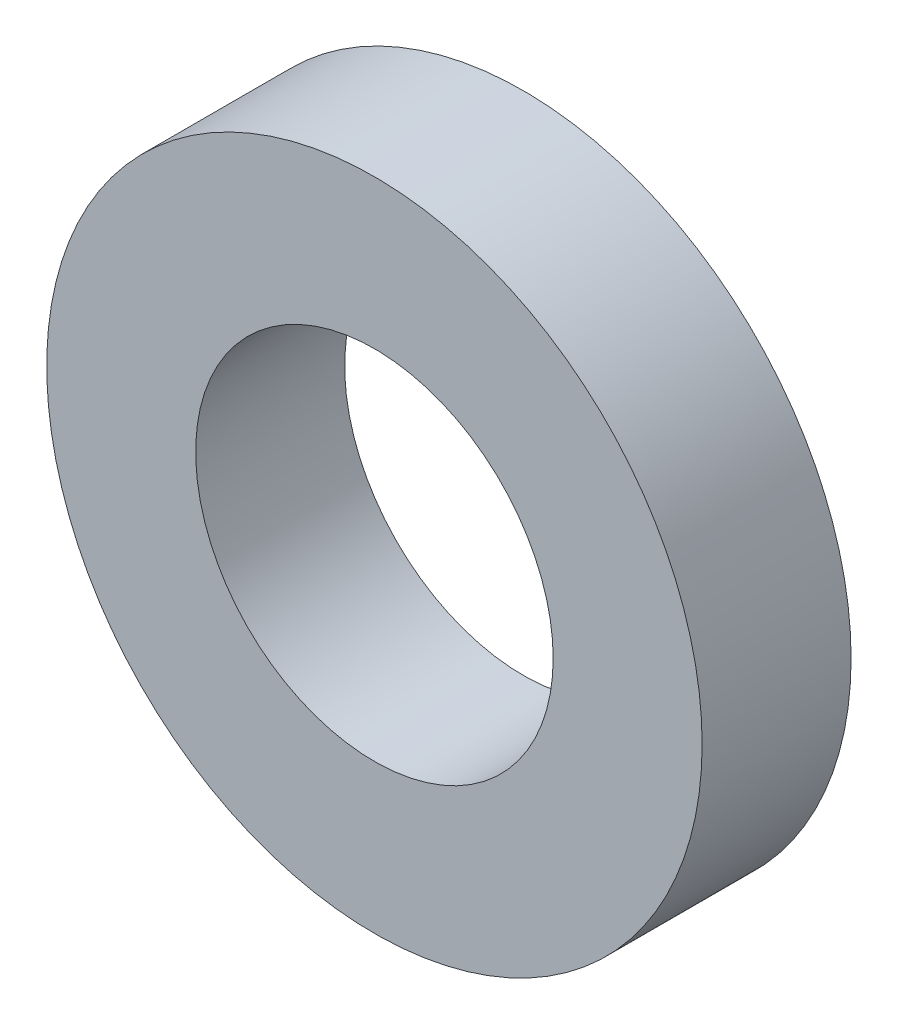
ISO-10303-21;
HEADER;
FILE_DESCRIPTION(('STEP AP214'),'2;1');
FILE_NAME('part.step','',(''),(''),'','','');
FILE_SCHEMA(('AUTOMOTIVE_DESIGN { 1 0 10303 214 1 1 1 1 }'));
ENDSEC;
DATA;
#1=APPLICATION_CONTEXT('core data for automotive mechanical design processes');
#2=APPLICATION_PROTOCOL_DEFINITION('international standard','automotive_design',2000,#1);
#3=PRODUCT_CONTEXT('',#1,'mechanical');
#4=PRODUCT('Part','Part','',(#3));
#5=PRODUCT_RELATED_PRODUCT_CATEGORY('part','',(#4));
#6=PRODUCT_DEFINITION_FORMATION('','',#4);
#7=PRODUCT_DEFINITION_CONTEXT('part definition',#1,'design');
#8=PRODUCT_DEFINITION('design','',#6,#7);
#9=PRODUCT_DEFINITION_SHAPE('','',#8);
#10=(LENGTH_UNIT() NAMED_UNIT(*) SI_UNIT(.MILLI.,.METRE.));
#11=(NAMED_UNIT(*) PLANE_ANGLE_UNIT() SI_UNIT($,.RADIAN.));
#12=(NAMED_UNIT(*) SI_UNIT($,.STERADIAN.) SOLID_ANGLE_UNIT());
#13=UNCERTAINTY_MEASURE_WITH_UNIT(LENGTH_MEASURE(1.E-05),#10,'distance_accuracy_value','');
#14=(GEOMETRIC_REPRESENTATION_CONTEXT(3) GLOBAL_UNCERTAINTY_ASSIGNED_CONTEXT((#13)) GLOBAL_UNIT_ASSIGNED_CONTEXT((#10,
#11,#12)) REPRESENTATION_CONTEXT('',''));
#15=CARTESIAN_POINT('',(0.,0.,0.));
#16=DIRECTION('',(0.,0.,1.));
#17=DIRECTION('',(1.,0.,0.));
#18=AXIS2_PLACEMENT_3D('',#15,#16,#17);
#19=CARTESIAN_POINT('',(0.,0.,10.));
#20=DIRECTION('',(0.,0.,-1.));
#21=DIRECTION('',(-1.,0.,0.));
#22=AXIS2_PLACEMENT_3D('',#19,#20,#21);
#23=CYLINDRICAL_SURFACE('',#22,22.);
#24=CARTESIAN_POINT('',(0.,0.,10.));
#25=DIRECTION('',(0.,0.,1.));
#26=DIRECTION('',(1.,0.,0.));
#27=AXIS2_PLACEMENT_3D('',#24,#25,#26);
#28=CIRCLE('',#27,22.);
#29=CARTESIAN_POINT('',(22.,0.,10.));
#30=VERTEX_POINT('',#29);
#31=EDGE_CURVE('E10',#30,#30,#28,.T.);
#32=ORIENTED_EDGE('',*,*,#31,.F.);
#33=EDGE_LOOP('',(#32));
#34=FACE_BOUND('',#33,.T.);
#35=CARTESIAN_POINT('',(0.,0.,0.));
#36=DIRECTION('',(0.,0.,1.));
#37=DIRECTION('',(1.,0.,0.));
#38=AXIS2_PLACEMENT_3D('',#35,#36,#37);
#39=CIRCLE('',#38,22.);
#40=CARTESIAN_POINT('',(22.,0.,0.));
#41=VERTEX_POINT('',#40);
#42=EDGE_CURVE('E51',#41,#41,#39,.T.);
#43=ORIENTED_EDGE('',*,*,#42,.T.);
#44=EDGE_LOOP('',(#43));
#45=FACE_BOUND('',#44,.T.);
#46=ADVANCED_FACE('F43',(#34,#45),#23,.T.);
#47=CARTESIAN_POINT('',(0.,0.,10.));
#48=DIRECTION('',(0.,0.,1.));
#49=DIRECTION('',(1.,0.,0.));
#50=AXIS2_PLACEMENT_3D('',#47,#48,#49);
#51=PLANE('',#50);
#52=CARTESIAN_POINT('',(0.,0.,10.));
#53=DIRECTION('',(0.,0.,1.));
#54=DIRECTION('',(1.,0.,0.));
#55=AXIS2_PLACEMENT_3D('',#52,#53,#54);
#56=CIRCLE('',#55,12.);
#57=CARTESIAN_POINT('',(12.,0.,10.));
#58=VERTEX_POINT('',#57);
#59=EDGE_CURVE('E58',#58,#58,#56,.T.);
#60=ORIENTED_EDGE('',*,*,#59,.F.);
#61=EDGE_LOOP('',(#60));
#62=FACE_BOUND('',#61,.T.);
#63=ORIENTED_EDGE('',*,*,#31,.T.);
#64=EDGE_LOOP('',(#63));
#65=FACE_BOUND('',#64,.T.);
#66=ADVANCED_FACE('F76',(#62,#65),#51,.T.);
#67=CARTESIAN_POINT('',(0.,0.,0.));
#68=DIRECTION('',(0.,0.,1.));
#69=DIRECTION('',(1.,0.,0.));
#70=AXIS2_PLACEMENT_3D('',#67,#68,#69);
#71=PLANE('',#70);
#72=CARTESIAN_POINT('',(0.,0.,0.));
#73=DIRECTION('',(0.,0.,1.));
#74=DIRECTION('',(1.,0.,0.));
#75=AXIS2_PLACEMENT_3D('',#72,#73,#74);
#76=CIRCLE('',#75,12.);
#77=CARTESIAN_POINT('',(12.,0.,0.));
#78=VERTEX_POINT('',#77);
#79=EDGE_CURVE('E46',#78,#78,#76,.T.);
#80=ORIENTED_EDGE('',*,*,#79,.T.);
#81=EDGE_LOOP('',(#80));
#82=FACE_BOUND('',#81,.T.);
#83=ORIENTED_EDGE('',*,*,#42,.F.);
#84=EDGE_LOOP('',(#83));
#85=FACE_BOUND('',#84,.T.);
#86=ADVANCED_FACE('F67',(#82,#85),#71,.F.);
#87=CARTESIAN_POINT('',(0.,0.,-15.));
#88=DIRECTION('',(0.,0.,1.));
#89=DIRECTION('',(1.,0.,0.));
#90=AXIS2_PLACEMENT_3D('',#87,#88,#89);
#91=CYLINDRICAL_SURFACE('',#90,12.);
#92=ORIENTED_EDGE('',*,*,#59,.T.);
#93=EDGE_LOOP('',(#92));
#94=FACE_BOUND('',#93,.T.);
#95=ORIENTED_EDGE('',*,*,#79,.F.);
#96=EDGE_LOOP('',(#95));
#97=FACE_BOUND('',#96,.T.);
#98=ADVANCED_FACE('F70',(#94,#97),#91,.F.);
#99=CLOSED_SHELL('',(#46,#66,#86,#98));
#100=MANIFOLD_SOLID_BREP('B2',#99);
#101=ADVANCED_BREP_SHAPE_REPRESENTATION('',(#18,#100),#14);
#102=SHAPE_DEFINITION_REPRESENTATION(#9,#101);
ENDSEC;
END-ISO-10303-21;
